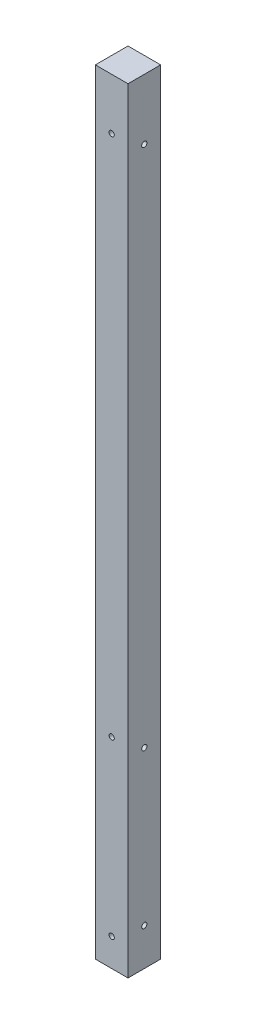
ISO-10303-21;
HEADER;
FILE_DESCRIPTION(('STEP AP214'),'2;1');
FILE_NAME('part.step','',(''),(''),'','','');
FILE_SCHEMA(('AUTOMOTIVE_DESIGN { 1 0 10303 214 1 1 1 1 }'));
ENDSEC;
DATA;
#1=APPLICATION_CONTEXT('core data for automotive mechanical design processes');
#2=APPLICATION_PROTOCOL_DEFINITION('international standard','automotive_design',2000,#1);
#3=PRODUCT_CONTEXT('',#1,'mechanical');
#4=PRODUCT('Part','Part','',(#3));
#5=PRODUCT_RELATED_PRODUCT_CATEGORY('part','',(#4));
#6=PRODUCT_DEFINITION_FORMATION('','',#4);
#7=PRODUCT_DEFINITION_CONTEXT('part definition',#1,'design');
#8=PRODUCT_DEFINITION('design','',#6,#7);
#9=PRODUCT_DEFINITION_SHAPE('','',#8);
#10=(LENGTH_UNIT() NAMED_UNIT(*) SI_UNIT(.MILLI.,.METRE.));
#11=(NAMED_UNIT(*) PLANE_ANGLE_UNIT() SI_UNIT($,.RADIAN.));
#12=(NAMED_UNIT(*) SI_UNIT($,.STERADIAN.) SOLID_ANGLE_UNIT());
#13=UNCERTAINTY_MEASURE_WITH_UNIT(LENGTH_MEASURE(1.E-05),#10,'distance_accuracy_value','');
#14=(GEOMETRIC_REPRESENTATION_CONTEXT(3) GLOBAL_UNCERTAINTY_ASSIGNED_CONTEXT((#13)) GLOBAL_UNIT_ASSIGNED_CONTEXT((#10,
#11,#12)) REPRESENTATION_CONTEXT('',''));
#15=CARTESIAN_POINT('',(0.,0.,0.));
#16=DIRECTION('',(0.,0.,1.));
#17=DIRECTION('',(1.,0.,0.));
#18=AXIS2_PLACEMENT_3D('',#15,#16,#17);
#19=CARTESIAN_POINT('',(44.45,2108.2,44.45));
#20=DIRECTION('',(-1.,0.,0.));
#21=DIRECTION('',(0.,0.,1.));
#22=AXIS2_PLACEMENT_3D('',#19,#20,#21);
#23=PLANE('',#22);
#24=CARTESIAN_POINT('',(44.45,101.6,0.));
#25=DIRECTION('',(1.,0.,0.));
#26=DIRECTION('',(0.,0.,-1.));
#27=AXIS2_PLACEMENT_3D('',#24,#25,#26);
#28=CIRCLE('',#27,7.14375000000001);
#29=CARTESIAN_POINT('',(44.45,101.6,-7.14375000000001));
#30=VERTEX_POINT('',#29);
#31=EDGE_CURVE('E151',#30,#30,#28,.T.);
#32=ORIENTED_EDGE('',*,*,#31,.F.);
#33=EDGE_LOOP('',(#32));
#34=FACE_BOUND('',#33,.T.);
#35=CARTESIAN_POINT('',(44.45,520.7,0.));
#36=DIRECTION('',(1.,0.,0.));
#37=DIRECTION('',(0.,0.,-1.));
#38=AXIS2_PLACEMENT_3D('',#35,#36,#37);
#39=CIRCLE('',#38,7.14374999999999);
#40=CARTESIAN_POINT('',(44.45,520.7,-7.14374999999999));
#41=VERTEX_POINT('',#40);
#42=EDGE_CURVE('E148',#41,#41,#39,.T.);
#43=ORIENTED_EDGE('',*,*,#42,.F.);
#44=EDGE_LOOP('',(#43));
#45=FACE_BOUND('',#44,.T.);
#46=CARTESIAN_POINT('',(44.45,1943.1,0.));
#47=DIRECTION('',(1.,0.,0.));
#48=DIRECTION('',(0.,0.,-1.));
#49=AXIS2_PLACEMENT_3D('',#46,#47,#48);
#50=CIRCLE('',#49,7.14375000000006);
#51=CARTESIAN_POINT('',(44.45,1943.1,-7.14375000000006));
#52=VERTEX_POINT('',#51);
#53=EDGE_CURVE('E142',#52,#52,#50,.T.);
#54=ORIENTED_EDGE('',*,*,#53,.F.);
#55=EDGE_LOOP('',(#54));
#56=FACE_BOUND('',#55,.T.);
#57=DIRECTION('',(0.,0.,-1.));
#58=VECTOR('',#57,1.);
#59=CARTESIAN_POINT('',(44.45,0.,44.45));
#60=LINE('',#59,#58);
#61=CARTESIAN_POINT('',(44.45,0.,44.45));
#62=VERTEX_POINT('',#61);
#63=CARTESIAN_POINT('',(44.45,0.,-44.45));
#64=VERTEX_POINT('',#63);
#65=EDGE_CURVE('E107',#62,#64,#60,.T.);
#66=ORIENTED_EDGE('',*,*,#65,.T.);
#67=DIRECTION('',(0.,-1.,0.));
#68=VECTOR('',#67,1.);
#69=CARTESIAN_POINT('',(44.45,2108.2,-44.45));
#70=LINE('',#69,#68);
#71=CARTESIAN_POINT('',(44.45,2108.2,-44.45));
#72=VERTEX_POINT('',#71);
#73=EDGE_CURVE('E11',#72,#64,#70,.T.);
#74=ORIENTED_EDGE('',*,*,#73,.F.);
#75=DIRECTION('',(0.,0.,-1.));
#76=VECTOR('',#75,1.);
#77=CARTESIAN_POINT('',(44.45,2108.2,44.45));
#78=LINE('',#77,#76);
#79=CARTESIAN_POINT('',(44.45,2108.2,44.45));
#80=VERTEX_POINT('',#79);
#81=EDGE_CURVE('E95',#80,#72,#78,.T.);
#82=ORIENTED_EDGE('',*,*,#81,.F.);
#83=DIRECTION('',(0.,-1.,0.));
#84=VECTOR('',#83,1.);
#85=CARTESIAN_POINT('',(44.45,2108.2,44.45));
#86=LINE('',#85,#84);
#87=EDGE_CURVE('E103',#80,#62,#86,.T.);
#88=ORIENTED_EDGE('',*,*,#87,.T.);
#89=EDGE_LOOP('',(#66,#74,#82,#88));
#90=FACE_BOUND('',#89,.T.);
#91=ADVANCED_FACE('F44',(#34,#45,#56,#90),#23,.F.);
#92=CARTESIAN_POINT('',(-44.45,2108.2,-44.45));
#93=DIRECTION('',(0.,0.,1.));
#94=DIRECTION('',(1.,0.,0.));
#95=AXIS2_PLACEMENT_3D('',#92,#93,#94);
#96=PLANE('',#95);
#97=CARTESIAN_POINT('',(0.,76.2,-44.45));
#98=DIRECTION('',(0.,0.,1.));
#99=DIRECTION('',(1.,0.,0.));
#100=AXIS2_PLACEMENT_3D('',#97,#98,#99);
#101=CIRCLE('',#100,7.14375);
#102=CARTESIAN_POINT('',(7.14375,76.2,-44.45));
#103=VERTEX_POINT('',#102);
#104=EDGE_CURVE('E110',#103,#103,#101,.T.);
#105=ORIENTED_EDGE('',*,*,#104,.T.);
#106=EDGE_LOOP('',(#105));
#107=FACE_BOUND('',#106,.T.);
#108=CARTESIAN_POINT('',(0.,546.1,-44.45));
#109=DIRECTION('',(0.,0.,1.));
#110=DIRECTION('',(1.,0.,0.));
#111=AXIS2_PLACEMENT_3D('',#108,#109,#110);
#112=CIRCLE('',#111,7.14374999999997);
#113=CARTESIAN_POINT('',(7.14374999999997,546.1,-44.45));
#114=VERTEX_POINT('',#113);
#115=EDGE_CURVE('E128',#114,#114,#112,.T.);
#116=ORIENTED_EDGE('',*,*,#115,.T.);
#117=EDGE_LOOP('',(#116));
#118=FACE_BOUND('',#117,.T.);
#119=CARTESIAN_POINT('',(0.,1968.5,-44.45));
#120=DIRECTION('',(0.,0.,1.));
#121=DIRECTION('',(1.,0.,0.));
#122=AXIS2_PLACEMENT_3D('',#119,#120,#121);
#123=CIRCLE('',#122,7.14375000000006);
#124=CARTESIAN_POINT('',(7.14375000000006,1968.5,-44.45));
#125=VERTEX_POINT('',#124);
#126=EDGE_CURVE('E121',#125,#125,#123,.T.);
#127=ORIENTED_EDGE('',*,*,#126,.T.);
#128=EDGE_LOOP('',(#127));
#129=FACE_BOUND('',#128,.T.);
#130=DIRECTION('',(-1.,0.,0.));
#131=VECTOR('',#130,1.);
#132=CARTESIAN_POINT('',(-44.45,0.,-44.45));
#133=LINE('',#132,#131);
#134=CARTESIAN_POINT('',(-44.45,0.,-44.45));
#135=VERTEX_POINT('',#134);
#136=EDGE_CURVE('E99',#64,#135,#133,.T.);
#137=ORIENTED_EDGE('',*,*,#136,.T.);
#138=DIRECTION('',(0.,-1.,0.));
#139=VECTOR('',#138,1.);
#140=CARTESIAN_POINT('',(-44.45,2108.2,-44.45));
#141=LINE('',#140,#139);
#142=CARTESIAN_POINT('',(-44.45,2108.2,-44.45));
#143=VERTEX_POINT('',#142);
#144=EDGE_CURVE('E52',#143,#135,#141,.T.);
#145=ORIENTED_EDGE('',*,*,#144,.F.);
#146=DIRECTION('',(-1.,0.,0.));
#147=VECTOR('',#146,1.);
#148=CARTESIAN_POINT('',(-44.45,2108.2,-44.45));
#149=LINE('',#148,#147);
#150=EDGE_CURVE('E90',#72,#143,#149,.T.);
#151=ORIENTED_EDGE('',*,*,#150,.F.);
#152=ORIENTED_EDGE('',*,*,#73,.T.);
#153=EDGE_LOOP('',(#137,#145,#151,#152));
#154=FACE_BOUND('',#153,.T.);
#155=ADVANCED_FACE('F98',(#107,#118,#129,#154),#96,.F.);
#156=CARTESIAN_POINT('',(-44.45,2108.2,44.45));
#157=DIRECTION('',(1.,0.,0.));
#158=DIRECTION('',(0.,0.,-1.));
#159=AXIS2_PLACEMENT_3D('',#156,#157,#158);
#160=PLANE('',#159);
#161=CARTESIAN_POINT('',(-44.45,101.6,0.));
#162=DIRECTION('',(1.,0.,0.));
#163=DIRECTION('',(0.,0.,-1.));
#164=AXIS2_PLACEMENT_3D('',#161,#162,#163);
#165=CIRCLE('',#164,7.14375000000001);
#166=CARTESIAN_POINT('',(-44.45,101.6,-7.14375000000001));
#167=VERTEX_POINT('',#166);
#168=EDGE_CURVE('E125',#167,#167,#165,.T.);
#169=ORIENTED_EDGE('',*,*,#168,.T.);
#170=EDGE_LOOP('',(#169));
#171=FACE_BOUND('',#170,.T.);
#172=CARTESIAN_POINT('',(-44.45,520.7,0.));
#173=DIRECTION('',(1.,0.,0.));
#174=DIRECTION('',(0.,0.,-1.));
#175=AXIS2_PLACEMENT_3D('',#172,#173,#174);
#176=CIRCLE('',#175,7.14374999999999);
#177=CARTESIAN_POINT('',(-44.45,520.7,-7.14374999999999));
#178=VERTEX_POINT('',#177);
#179=EDGE_CURVE('E145',#178,#178,#176,.T.);
#180=ORIENTED_EDGE('',*,*,#179,.T.);
#181=EDGE_LOOP('',(#180));
#182=FACE_BOUND('',#181,.T.);
#183=CARTESIAN_POINT('',(-44.45,1943.1,0.));
#184=DIRECTION('',(1.,0.,0.));
#185=DIRECTION('',(0.,0.,-1.));
#186=AXIS2_PLACEMENT_3D('',#183,#184,#185);
#187=CIRCLE('',#186,7.14375000000006);
#188=CARTESIAN_POINT('',(-44.45,1943.1,-7.14375000000006));
#189=VERTEX_POINT('',#188);
#190=EDGE_CURVE('E139',#189,#189,#187,.T.);
#191=ORIENTED_EDGE('',*,*,#190,.T.);
#192=EDGE_LOOP('',(#191));
#193=FACE_BOUND('',#192,.T.);
#194=DIRECTION('',(0.,0.,1.));
#195=VECTOR('',#194,1.);
#196=CARTESIAN_POINT('',(-44.45,0.,44.45));
#197=LINE('',#196,#195);
#198=CARTESIAN_POINT('',(-44.45,0.,44.45));
#199=VERTEX_POINT('',#198);
#200=EDGE_CURVE('E77',#135,#199,#197,.T.);
#201=ORIENTED_EDGE('',*,*,#200,.T.);
#202=DIRECTION('',(0.,-1.,0.));
#203=VECTOR('',#202,1.);
#204=CARTESIAN_POINT('',(-44.45,2108.2,44.45));
#205=LINE('',#204,#203);
#206=CARTESIAN_POINT('',(-44.45,2108.2,44.45));
#207=VERTEX_POINT('',#206);
#208=EDGE_CURVE('E100',#207,#199,#205,.T.);
#209=ORIENTED_EDGE('',*,*,#208,.F.);
#210=DIRECTION('',(0.,0.,1.));
#211=VECTOR('',#210,1.);
#212=CARTESIAN_POINT('',(-44.45,2108.2,44.45));
#213=LINE('',#212,#211);
#214=EDGE_CURVE('E93',#143,#207,#213,.T.);
#215=ORIENTED_EDGE('',*,*,#214,.F.);
#216=ORIENTED_EDGE('',*,*,#144,.T.);
#217=EDGE_LOOP('',(#201,#209,#215,#216));
#218=FACE_BOUND('',#217,.T.);
#219=ADVANCED_FACE('F101',(#171,#182,#193,#218),#160,.F.);
#220=CARTESIAN_POINT('',(-44.45,2108.2,44.45));
#221=DIRECTION('',(0.,0.,-1.));
#222=DIRECTION('',(-1.,0.,0.));
#223=AXIS2_PLACEMENT_3D('',#220,#221,#222);
#224=PLANE('',#223);
#225=CARTESIAN_POINT('',(0.,76.2,44.45));
#226=DIRECTION('',(0.,0.,1.));
#227=DIRECTION('',(1.,0.,0.));
#228=AXIS2_PLACEMENT_3D('',#225,#226,#227);
#229=CIRCLE('',#228,7.14375);
#230=CARTESIAN_POINT('',(7.14375,76.2,44.45));
#231=VERTEX_POINT('',#230);
#232=EDGE_CURVE('E134',#231,#231,#229,.T.);
#233=ORIENTED_EDGE('',*,*,#232,.F.);
#234=EDGE_LOOP('',(#233));
#235=FACE_BOUND('',#234,.T.);
#236=CARTESIAN_POINT('',(0.,546.1,44.45));
#237=DIRECTION('',(0.,0.,1.));
#238=DIRECTION('',(1.,0.,0.));
#239=AXIS2_PLACEMENT_3D('',#236,#237,#238);
#240=CIRCLE('',#239,7.14374999999997);
#241=CARTESIAN_POINT('',(7.14374999999997,546.1,44.45));
#242=VERTEX_POINT('',#241);
#243=EDGE_CURVE('E131',#242,#242,#240,.T.);
#244=ORIENTED_EDGE('',*,*,#243,.F.);
#245=EDGE_LOOP('',(#244));
#246=FACE_BOUND('',#245,.T.);
#247=CARTESIAN_POINT('',(0.,1968.5,44.45));
#248=DIRECTION('',(0.,0.,1.));
#249=DIRECTION('',(1.,0.,0.));
#250=AXIS2_PLACEMENT_3D('',#247,#248,#249);
#251=CIRCLE('',#250,7.14375000000006);
#252=CARTESIAN_POINT('',(7.14375000000006,1968.5,44.45));
#253=VERTEX_POINT('',#252);
#254=EDGE_CURVE('E124',#253,#253,#251,.T.);
#255=ORIENTED_EDGE('',*,*,#254,.F.);
#256=EDGE_LOOP('',(#255));
#257=FACE_BOUND('',#256,.T.);
#258=DIRECTION('',(1.,0.,0.));
#259=VECTOR('',#258,1.);
#260=CARTESIAN_POINT('',(-44.45,0.,44.45));
#261=LINE('',#260,#259);
#262=EDGE_CURVE('E83',#199,#62,#261,.T.);
#263=ORIENTED_EDGE('',*,*,#262,.T.);
#264=ORIENTED_EDGE('',*,*,#87,.F.);
#265=DIRECTION('',(1.,0.,0.));
#266=VECTOR('',#265,1.);
#267=CARTESIAN_POINT('',(-44.45,2108.2,44.45));
#268=LINE('',#267,#266);
#269=EDGE_CURVE('E60',#207,#80,#268,.T.);
#270=ORIENTED_EDGE('',*,*,#269,.F.);
#271=ORIENTED_EDGE('',*,*,#208,.T.);
#272=EDGE_LOOP('',(#263,#264,#270,#271));
#273=FACE_BOUND('',#272,.T.);
#274=ADVANCED_FACE('F115',(#235,#246,#257,#273),#224,.F.);
#275=CARTESIAN_POINT('',(0.,2108.2,0.));
#276=DIRECTION('',(0.,-1.,0.));
#277=DIRECTION('',(0.,0.,-1.));
#278=AXIS2_PLACEMENT_3D('',#275,#276,#277);
#279=PLANE('',#278);
#280=ORIENTED_EDGE('',*,*,#81,.T.);
#281=ORIENTED_EDGE('',*,*,#150,.T.);
#282=ORIENTED_EDGE('',*,*,#214,.T.);
#283=ORIENTED_EDGE('',*,*,#269,.T.);
#284=EDGE_LOOP('',(#280,#281,#282,#283));
#285=FACE_BOUND('',#284,.T.);
#286=ADVANCED_FACE('F91',(#285),#279,.F.);
#287=CARTESIAN_POINT('',(0.,0.,0.));
#288=DIRECTION('',(0.,-1.,0.));
#289=DIRECTION('',(0.,0.,-1.));
#290=AXIS2_PLACEMENT_3D('',#287,#288,#289);
#291=PLANE('',#290);
#292=ORIENTED_EDGE('',*,*,#65,.F.);
#293=ORIENTED_EDGE('',*,*,#262,.F.);
#294=ORIENTED_EDGE('',*,*,#200,.F.);
#295=ORIENTED_EDGE('',*,*,#136,.F.);
#296=EDGE_LOOP('',(#292,#293,#294,#295));
#297=FACE_BOUND('',#296,.T.);
#298=ADVANCED_FACE('F118',(#297),#291,.T.);
#299=CARTESIAN_POINT('',(0.,1968.5,-44.45));
#300=DIRECTION('',(0.,0.,1.));
#301=DIRECTION('',(1.,0.,0.));
#302=AXIS2_PLACEMENT_3D('',#299,#300,#301);
#303=CYLINDRICAL_SURFACE('',#302,7.14375000000006);
#304=ORIENTED_EDGE('',*,*,#126,.F.);
#305=EDGE_LOOP('',(#304));
#306=FACE_BOUND('',#305,.T.);
#307=ORIENTED_EDGE('',*,*,#254,.T.);
#308=EDGE_LOOP('',(#307));
#309=FACE_BOUND('',#308,.T.);
#310=ADVANCED_FACE('F190',(#306,#309),#303,.F.);
#311=CARTESIAN_POINT('',(0.,546.1,-44.45));
#312=DIRECTION('',(0.,0.,1.));
#313=DIRECTION('',(1.,0.,0.));
#314=AXIS2_PLACEMENT_3D('',#311,#312,#313);
#315=CYLINDRICAL_SURFACE('',#314,7.14374999999997);
#316=ORIENTED_EDGE('',*,*,#115,.F.);
#317=EDGE_LOOP('',(#316));
#318=FACE_BOUND('',#317,.T.);
#319=ORIENTED_EDGE('',*,*,#243,.T.);
#320=EDGE_LOOP('',(#319));
#321=FACE_BOUND('',#320,.T.);
#322=ADVANCED_FACE('F183',(#318,#321),#315,.F.);
#323=CARTESIAN_POINT('',(0.,76.2,-44.45));
#324=DIRECTION('',(0.,0.,1.));
#325=DIRECTION('',(1.,0.,0.));
#326=AXIS2_PLACEMENT_3D('',#323,#324,#325);
#327=CYLINDRICAL_SURFACE('',#326,7.14375);
#328=ORIENTED_EDGE('',*,*,#104,.F.);
#329=EDGE_LOOP('',(#328));
#330=FACE_BOUND('',#329,.T.);
#331=ORIENTED_EDGE('',*,*,#232,.T.);
#332=EDGE_LOOP('',(#331));
#333=FACE_BOUND('',#332,.T.);
#334=ADVANCED_FACE('F174',(#330,#333),#327,.F.);
#335=CARTESIAN_POINT('',(-44.45,1943.1,0.));
#336=DIRECTION('',(1.,0.,0.));
#337=DIRECTION('',(0.,0.,-1.));
#338=AXIS2_PLACEMENT_3D('',#335,#336,#337);
#339=CYLINDRICAL_SURFACE('',#338,7.14375000000006);
#340=ORIENTED_EDGE('',*,*,#190,.F.);
#341=EDGE_LOOP('',(#340));
#342=FACE_BOUND('',#341,.T.);
#343=ORIENTED_EDGE('',*,*,#53,.T.);
#344=EDGE_LOOP('',(#343));
#345=FACE_BOUND('',#344,.T.);
#346=ADVANCED_FACE('F172',(#342,#345),#339,.F.);
#347=CARTESIAN_POINT('',(-44.45,520.7,0.));
#348=DIRECTION('',(1.,0.,0.));
#349=DIRECTION('',(0.,0.,-1.));
#350=AXIS2_PLACEMENT_3D('',#347,#348,#349);
#351=CYLINDRICAL_SURFACE('',#350,7.14374999999999);
#352=ORIENTED_EDGE('',*,*,#179,.F.);
#353=EDGE_LOOP('',(#352));
#354=FACE_BOUND('',#353,.T.);
#355=ORIENTED_EDGE('',*,*,#42,.T.);
#356=EDGE_LOOP('',(#355));
#357=FACE_BOUND('',#356,.T.);
#358=ADVANCED_FACE('F162',(#354,#357),#351,.F.);
#359=CARTESIAN_POINT('',(-44.45,101.6,0.));
#360=DIRECTION('',(1.,0.,0.));
#361=DIRECTION('',(0.,0.,-1.));
#362=AXIS2_PLACEMENT_3D('',#359,#360,#361);
#363=CYLINDRICAL_SURFACE('',#362,7.14375000000001);
#364=ORIENTED_EDGE('',*,*,#168,.F.);
#365=EDGE_LOOP('',(#364));
#366=FACE_BOUND('',#365,.T.);
#367=ORIENTED_EDGE('',*,*,#31,.T.);
#368=EDGE_LOOP('',(#367));
#369=FACE_BOUND('',#368,.T.);
#370=ADVANCED_FACE('F159',(#366,#369),#363,.F.);
#371=CLOSED_SHELL('',(#91,#155,#219,#274,#286,#298,#310,#322,#334,#346,#358,#370));
#372=MANIFOLD_SOLID_BREP('B2',#371);
#373=ADVANCED_BREP_SHAPE_REPRESENTATION('',(#18,#372),#14);
#374=SHAPE_DEFINITION_REPRESENTATION(#9,#373);
ENDSEC;
END-ISO-10303-21;
